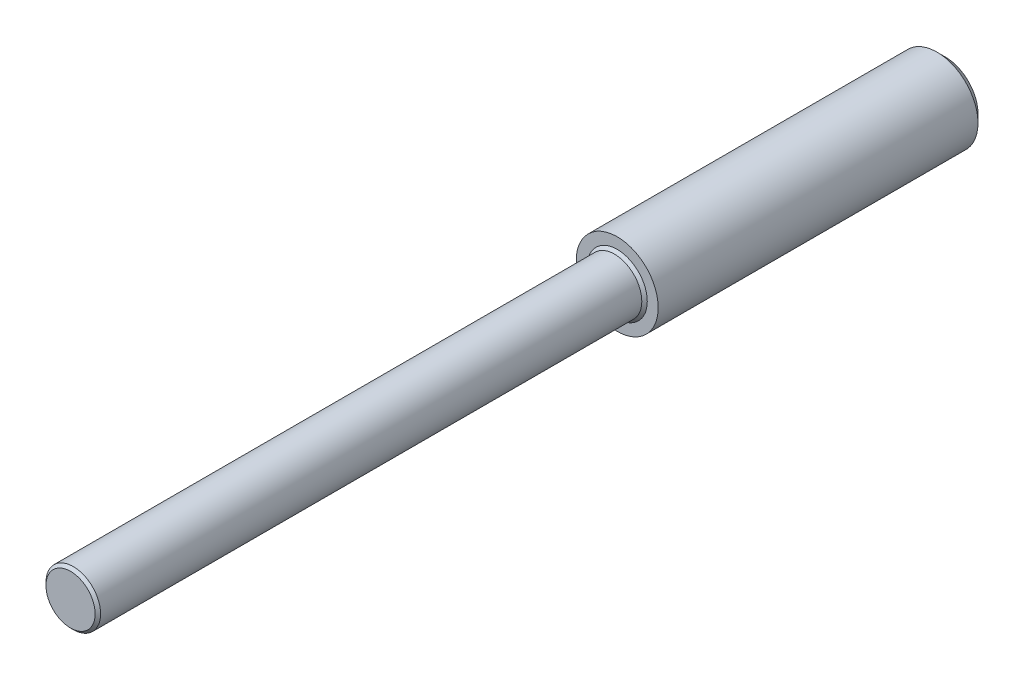
ISO-10303-21;
HEADER;
FILE_DESCRIPTION(('STEP AP214'),'2;1');
FILE_NAME('part.step','',(''),(''),'','','');
FILE_SCHEMA(('AUTOMOTIVE_DESIGN { 1 0 10303 214 1 1 1 1 }'));
ENDSEC;
DATA;
#1=APPLICATION_CONTEXT('core data for automotive mechanical design processes');
#2=APPLICATION_PROTOCOL_DEFINITION('international standard','automotive_design',2000,#1);
#3=PRODUCT_CONTEXT('',#1,'mechanical');
#4=PRODUCT('Part','Part','',(#3));
#5=PRODUCT_RELATED_PRODUCT_CATEGORY('part','',(#4));
#6=PRODUCT_DEFINITION_FORMATION('','',#4);
#7=PRODUCT_DEFINITION_CONTEXT('part definition',#1,'design');
#8=PRODUCT_DEFINITION('design','',#6,#7);
#9=PRODUCT_DEFINITION_SHAPE('','',#8);
#10=(LENGTH_UNIT() NAMED_UNIT(*) SI_UNIT(.MILLI.,.METRE.));
#11=(NAMED_UNIT(*) PLANE_ANGLE_UNIT() SI_UNIT($,.RADIAN.));
#12=(NAMED_UNIT(*) SI_UNIT($,.STERADIAN.) SOLID_ANGLE_UNIT());
#13=UNCERTAINTY_MEASURE_WITH_UNIT(LENGTH_MEASURE(1.E-05),#10,'distance_accuracy_value','');
#14=(GEOMETRIC_REPRESENTATION_CONTEXT(3) GLOBAL_UNCERTAINTY_ASSIGNED_CONTEXT((#13)) GLOBAL_UNIT_ASSIGNED_CONTEXT((#10,
#11,#12)) REPRESENTATION_CONTEXT('',''));
#15=CARTESIAN_POINT('',(0.,0.,0.));
#16=DIRECTION('',(0.,0.,1.));
#17=DIRECTION('',(1.,0.,0.));
#18=AXIS2_PLACEMENT_3D('',#15,#16,#17);
#19=CARTESIAN_POINT('',(0.,0.,12.));
#20=DIRECTION('',(0.,0.,-1.));
#21=DIRECTION('',(-1.,0.,0.));
#22=AXIS2_PLACEMENT_3D('',#19,#20,#21);
#23=CYLINDRICAL_SURFACE('',#22,1.5);
#24=CARTESIAN_POINT('',(0.,0.,0.299999999999998));
#25=DIRECTION('',(0.,0.,1.));
#26=DIRECTION('',(1.,0.,0.));
#27=AXIS2_PLACEMENT_3D('',#24,#25,#26);
#28=CIRCLE('',#27,1.5);
#29=CARTESIAN_POINT('',(1.5,0.,0.299999999999998));
#30=VERTEX_POINT('',#29);
#31=EDGE_CURVE('E54',#30,#30,#28,.T.);
#32=ORIENTED_EDGE('',*,*,#31,.T.);
#33=EDGE_LOOP('',(#32));
#34=FACE_BOUND('',#33,.T.);
#35=CARTESIAN_POINT('',(0.,0.,12.));
#36=DIRECTION('',(0.,0.,1.));
#37=DIRECTION('',(1.,0.,0.));
#38=AXIS2_PLACEMENT_3D('',#35,#36,#37);
#39=CIRCLE('',#38,1.5);
#40=CARTESIAN_POINT('',(1.5,0.,12.));
#41=VERTEX_POINT('',#40);
#42=EDGE_CURVE('E57',#41,#41,#39,.T.);
#43=ORIENTED_EDGE('',*,*,#42,.F.);
#44=EDGE_LOOP('',(#43));
#45=FACE_BOUND('',#44,.T.);
#46=ADVANCED_FACE('F31',(#34,#45),#23,.T.);
#47=CARTESIAN_POINT('',(0.,0.,12.));
#48=DIRECTION('',(0.,0.,1.));
#49=DIRECTION('',(1.,0.,0.));
#50=AXIS2_PLACEMENT_3D('',#47,#48,#49);
#51=PLANE('',#50);
#52=CARTESIAN_POINT('',(0.,0.,12.));
#53=DIRECTION('',(0.,0.,1.));
#54=DIRECTION('',(1.,0.,0.));
#55=AXIS2_PLACEMENT_3D('',#52,#53,#54);
#56=CIRCLE('',#55,1.1);
#57=CARTESIAN_POINT('',(1.1,0.,12.));
#58=VERTEX_POINT('',#57);
#59=EDGE_CURVE('E38',#58,#58,#56,.F.);
#60=ORIENTED_EDGE('',*,*,#59,.T.);
#61=EDGE_LOOP('',(#60));
#62=FACE_BOUND('',#61,.T.);
#63=ORIENTED_EDGE('',*,*,#42,.T.);
#64=EDGE_LOOP('',(#63));
#65=FACE_BOUND('',#64,.T.);
#66=ADVANCED_FACE('F61',(#62,#65),#51,.T.);
#67=CARTESIAN_POINT('',(0.,0.,0.));
#68=DIRECTION('',(0.,0.,1.));
#69=DIRECTION('',(1.,0.,0.));
#70=AXIS2_PLACEMENT_3D('',#67,#68,#69);
#71=PLANE('',#70);
#72=CARTESIAN_POINT('',(0.,0.,0.));
#73=DIRECTION('',(0.,0.,1.));
#74=DIRECTION('',(1.,0.,0.));
#75=AXIS2_PLACEMENT_3D('',#72,#73,#74);
#76=CIRCLE('',#75,1.2);
#77=CARTESIAN_POINT('',(1.2,0.,0.));
#78=VERTEX_POINT('',#77);
#79=EDGE_CURVE('E51',#78,#78,#76,.F.);
#80=ORIENTED_EDGE('',*,*,#79,.T.);
#81=EDGE_LOOP('',(#80));
#82=FACE_BOUND('',#81,.T.);
#83=ADVANCED_FACE('F69',(#82),#71,.F.);
#84=CARTESIAN_POINT('',(0.,0.,32.));
#85=DIRECTION('',(0.,0.,-1.));
#86=DIRECTION('',(-1.,0.,0.));
#87=AXIS2_PLACEMENT_3D('',#84,#85,#86);
#88=CYLINDRICAL_SURFACE('',#87,1.);
#89=CARTESIAN_POINT('',(0.,0.,12.1));
#90=DIRECTION('',(0.,0.,1.));
#91=DIRECTION('',(1.,0.,0.));
#92=AXIS2_PLACEMENT_3D('',#89,#90,#91);
#93=CIRCLE('',#92,1.);
#94=CARTESIAN_POINT('',(1.,0.,12.1));
#95=VERTEX_POINT('',#94);
#96=EDGE_CURVE('E42',#95,#95,#93,.T.);
#97=ORIENTED_EDGE('',*,*,#96,.T.);
#98=EDGE_LOOP('',(#97));
#99=FACE_BOUND('',#98,.T.);
#100=CARTESIAN_POINT('',(0.,0.,31.9));
#101=DIRECTION('',(0.,0.,1.));
#102=DIRECTION('',(1.,0.,0.));
#103=AXIS2_PLACEMENT_3D('',#100,#101,#102);
#104=CIRCLE('',#103,1.);
#105=CARTESIAN_POINT('',(1.,0.,31.9));
#106=VERTEX_POINT('',#105);
#107=EDGE_CURVE('E46',#106,#106,#104,.F.);
#108=ORIENTED_EDGE('',*,*,#107,.T.);
#109=EDGE_LOOP('',(#108));
#110=FACE_BOUND('',#109,.T.);
#111=ADVANCED_FACE('F87',(#99,#110),#88,.T.);
#112=CARTESIAN_POINT('',(0.,0.,32.));
#113=DIRECTION('',(0.,0.,1.));
#114=DIRECTION('',(1.,0.,0.));
#115=AXIS2_PLACEMENT_3D('',#112,#113,#114);
#116=PLANE('',#115);
#117=CARTESIAN_POINT('',(0.,0.,32.));
#118=DIRECTION('',(0.,0.,1.));
#119=DIRECTION('',(1.,0.,0.));
#120=AXIS2_PLACEMENT_3D('',#117,#118,#119);
#121=CIRCLE('',#120,0.899999999999998);
#122=CARTESIAN_POINT('',(0.899999999999998,0.,32.));
#123=VERTEX_POINT('',#122);
#124=EDGE_CURVE('E10',#123,#123,#121,.T.);
#125=ORIENTED_EDGE('',*,*,#124,.T.);
#126=EDGE_LOOP('',(#125));
#127=FACE_BOUND('',#126,.T.);
#128=ADVANCED_FACE('F76',(#127),#116,.T.);
#129=CARTESIAN_POINT('',(0.,0.,0.299999999999998));
#130=DIRECTION('',(0.,0.,1.));
#131=DIRECTION('',(1.,0.,0.));
#132=AXIS2_PLACEMENT_3D('',#129,#130,#131);
#133=CONICAL_SURFACE('',#132,1.5,0.785398163397452);
#134=ORIENTED_EDGE('',*,*,#79,.F.);
#135=EDGE_LOOP('',(#134));
#136=FACE_BOUND('',#135,.T.);
#137=ORIENTED_EDGE('',*,*,#31,.F.);
#138=EDGE_LOOP('',(#137));
#139=FACE_BOUND('',#138,.T.);
#140=ADVANCED_FACE('F73',(#136,#139),#133,.T.);
#141=CARTESIAN_POINT('',(0.,0.,12.1));
#142=DIRECTION('',(0.,0.,-1.));
#143=DIRECTION('',(-1.,0.,0.));
#144=AXIS2_PLACEMENT_3D('',#141,#142,#143);
#145=CONICAL_SURFACE('',#144,1.,0.78539816339747);
#146=ORIENTED_EDGE('',*,*,#59,.F.);
#147=EDGE_LOOP('',(#146));
#148=FACE_BOUND('',#147,.T.);
#149=ORIENTED_EDGE('',*,*,#96,.F.);
#150=EDGE_LOOP('',(#149));
#151=FACE_BOUND('',#150,.T.);
#152=ADVANCED_FACE('F75',(#148,#151),#145,.T.);
#153=CARTESIAN_POINT('',(0.,0.,32.));
#154=DIRECTION('',(0.,0.,-1.));
#155=DIRECTION('',(-1.,0.,0.));
#156=AXIS2_PLACEMENT_3D('',#153,#154,#155);
#157=CONICAL_SURFACE('',#156,0.899999999999998,0.785398163397409);
#158=ORIENTED_EDGE('',*,*,#107,.F.);
#159=EDGE_LOOP('',(#158));
#160=FACE_BOUND('',#159,.T.);
#161=ORIENTED_EDGE('',*,*,#124,.F.);
#162=EDGE_LOOP('',(#161));
#163=FACE_BOUND('',#162,.T.);
#164=ADVANCED_FACE('F33',(#160,#163),#157,.T.);
#165=CLOSED_SHELL('',(#46,#66,#83,#111,#128,#140,#152,#164));
#166=MANIFOLD_SOLID_BREP('B2',#165);
#167=ADVANCED_BREP_SHAPE_REPRESENTATION('',(#18,#166),#14);
#168=SHAPE_DEFINITION_REPRESENTATION(#9,#167);
ENDSEC;
END-ISO-10303-21;
